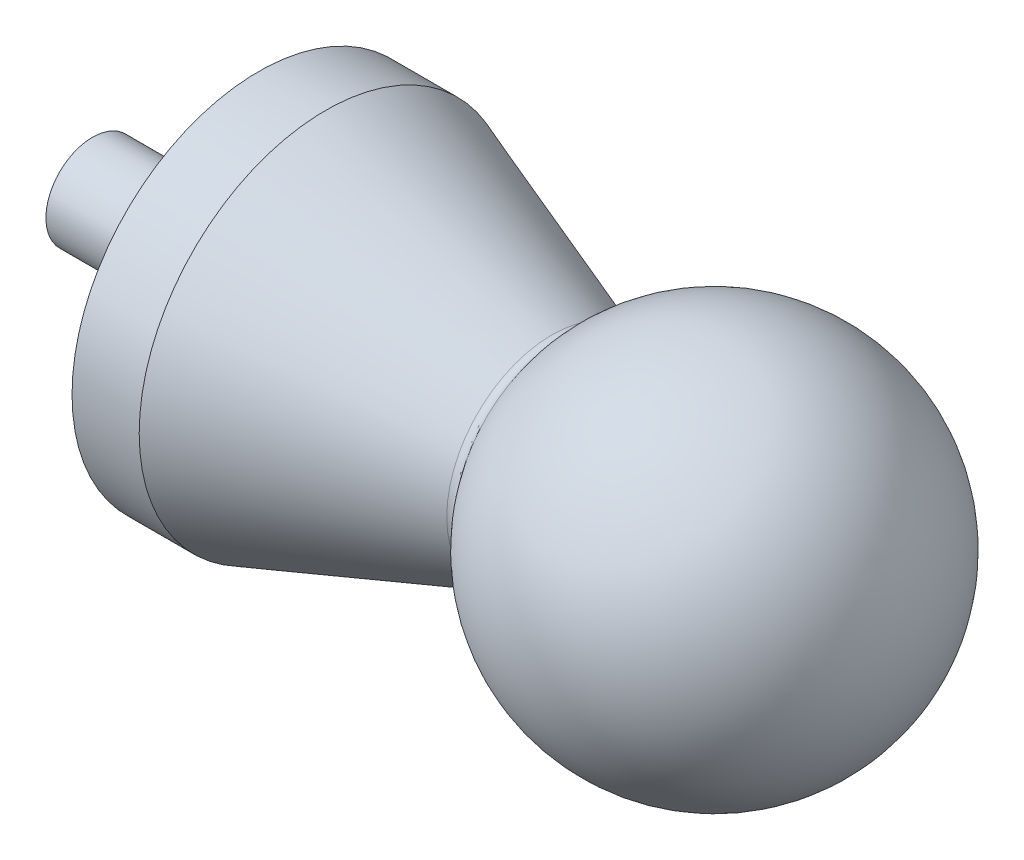
ISO-10303-21;
HEADER;
FILE_DESCRIPTION(('STEP AP214'),'2;1');
FILE_NAME('part.step','',(''),(''),'','','');
FILE_SCHEMA(('AUTOMOTIVE_DESIGN { 1 0 10303 214 1 1 1 1 }'));
ENDSEC;
DATA;
#1=APPLICATION_CONTEXT('core data for automotive mechanical design processes');
#2=APPLICATION_PROTOCOL_DEFINITION('international standard','automotive_design',2000,#1);
#3=PRODUCT_CONTEXT('',#1,'mechanical');
#4=PRODUCT('Part','Part','',(#3));
#5=PRODUCT_RELATED_PRODUCT_CATEGORY('part','',(#4));
#6=PRODUCT_DEFINITION_FORMATION('','',#4);
#7=PRODUCT_DEFINITION_CONTEXT('part definition',#1,'design');
#8=PRODUCT_DEFINITION('design','',#6,#7);
#9=PRODUCT_DEFINITION_SHAPE('','',#8);
#10=(LENGTH_UNIT() NAMED_UNIT(*) SI_UNIT(.MILLI.,.METRE.));
#11=(NAMED_UNIT(*) PLANE_ANGLE_UNIT() SI_UNIT($,.RADIAN.));
#12=(NAMED_UNIT(*) SI_UNIT($,.STERADIAN.) SOLID_ANGLE_UNIT());
#13=UNCERTAINTY_MEASURE_WITH_UNIT(LENGTH_MEASURE(1.E-05),#10,'distance_accuracy_value','');
#14=(GEOMETRIC_REPRESENTATION_CONTEXT(3) GLOBAL_UNCERTAINTY_ASSIGNED_CONTEXT((#13)) GLOBAL_UNIT_ASSIGNED_CONTEXT((#10,
#11,#12)) REPRESENTATION_CONTEXT('',''));
#15=CARTESIAN_POINT('',(0.,0.,0.));
#16=DIRECTION('',(0.,0.,1.));
#17=DIRECTION('',(1.,0.,0.));
#18=AXIS2_PLACEMENT_3D('',#15,#16,#17);
#19=CARTESIAN_POINT('',(25.0028109522093,0.,0.));
#20=DIRECTION('',(1.,0.,0.));
#21=DIRECTION('',(0.,0.,-1.));
#22=AXIS2_PLACEMENT_3D('',#19,#20,#21);
#23=CYLINDRICAL_SURFACE('',#22,9.99999900000003);
#24=CARTESIAN_POINT('',(-133.33332,0.,0.));
#25=DIRECTION('',(1.,0.,0.));
#26=DIRECTION('',(0.,0.,-1.));
#27=AXIS2_PLACEMENT_3D('',#24,#25,#26);
#28=CIRCLE('',#27,9.99999900000003);
#29=CARTESIAN_POINT('',(-133.33332,0.,-9.99999900000003));
#30=VERTEX_POINT('',#29);
#31=EDGE_CURVE('E42',#30,#30,#28,.T.);
#32=ORIENTED_EDGE('',*,*,#31,.T.);
#33=EDGE_LOOP('',(#32));
#34=FACE_BOUND('',#33,.T.);
#35=CARTESIAN_POINT('',(-97.73332356,0.,0.));
#36=DIRECTION('',(1.,0.,0.));
#37=DIRECTION('',(0.,0.,-1.));
#38=AXIS2_PLACEMENT_3D('',#35,#36,#37);
#39=CIRCLE('',#38,9.99999900000003);
#40=CARTESIAN_POINT('',(-97.73332356,0.,-9.99999900000003));
#41=VERTEX_POINT('',#40);
#42=EDGE_CURVE('E54',#41,#41,#39,.T.);
#43=ORIENTED_EDGE('',*,*,#42,.F.);
#44=EDGE_LOOP('',(#43));
#45=FACE_BOUND('',#44,.T.);
#46=ADVANCED_FACE('F31',(#34,#45),#23,.T.);
#47=CARTESIAN_POINT('',(-133.33332,0.,0.));
#48=DIRECTION('',(-1.,0.,0.));
#49=DIRECTION('',(0.,0.,1.));
#50=AXIS2_PLACEMENT_3D('',#47,#48,#49);
#51=PLANE('',#50);
#52=ORIENTED_EDGE('',*,*,#31,.F.);
#53=EDGE_LOOP('',(#52));
#54=FACE_BOUND('',#53,.T.);
#55=ADVANCED_FACE('F62',(#54),#51,.T.);
#56=CARTESIAN_POINT('',(0.,0.,0.));
#57=DIRECTION('',(1.,0.,0.));
#58=DIRECTION('',(0.,0.,1.));
#59=AXIS2_PLACEMENT_3D('',#56,#57,#58);
#60=SPHERICAL_SURFACE('',#59,40.);
#61=CARTESIAN_POINT('',(-32.5399748618754,0.,0.));
#62=DIRECTION('',(1.,0.,0.));
#63=DIRECTION('',(0.,0.,-1.));
#64=AXIS2_PLACEMENT_3D('',#61,#62,#63);
#65=CIRCLE('',#64,23.2626317511265);
#66=CARTESIAN_POINT('',(-32.5399748618754,0.,-23.2626317511265));
#67=VERTEX_POINT('',#66);
#68=EDGE_CURVE('E38',#67,#67,#65,.T.);
#69=ORIENTED_EDGE('',*,*,#68,.T.);
#70=EDGE_LOOP('',(#69));
#71=FACE_BOUND('',#70,.T.);
#72=ADVANCED_FACE('F67',(#71),#60,.T.);
#73=CARTESIAN_POINT('',(-33.3925398117719,0.,0.));
#74=DIRECTION('',(-1.,0.,0.));
#75=DIRECTION('',(0.,0.,1.));
#76=AXIS2_PLACEMENT_3D('',#73,#74,#75);
#77=CONICAL_SURFACE('',#76,22.0213143322379,0.345555580581712);
#78=CARTESIAN_POINT('',(-34.8444125415147,0.,0.));
#79=DIRECTION('',(-1.,0.,0.));
#80=DIRECTION('',(0.,0.,1.));
#81=AXIS2_PLACEMENT_3D('',#78,#79,#80);
#82=CIRCLE('',#81,22.5439885149453);
#83=CARTESIAN_POINT('',(-34.8444125415147,0.,22.5439885149453));
#84=VERTEX_POINT('',#83);
#85=EDGE_CURVE('E10',#84,#84,#82,.T.);
#86=ORIENTED_EDGE('',*,*,#85,.T.);
#87=EDGE_LOOP('',(#86));
#88=FACE_BOUND('',#87,.T.);
#89=CARTESIAN_POINT('',(-83.333328339254,0.,0.));
#90=DIRECTION('',(1.,0.,0.));
#91=DIRECTION('',(0.,0.,-1.));
#92=AXIS2_PLACEMENT_3D('',#89,#90,#91);
#93=CIRCLE('',#92,39.9999982021314);
#94=CARTESIAN_POINT('',(-83.333328339254,0.,-39.9999982021314));
#95=VERTEX_POINT('',#94);
#96=EDGE_CURVE('E46',#95,#95,#93,.T.);
#97=ORIENTED_EDGE('',*,*,#96,.T.);
#98=EDGE_LOOP('',(#97));
#99=FACE_BOUND('',#98,.T.);
#100=ADVANCED_FACE('F73',(#88,#99),#77,.T.);
#101=CARTESIAN_POINT('',(25.0028109522093,0.,0.));
#102=DIRECTION('',(1.,0.,0.));
#103=DIRECTION('',(0.,0.,-1.));
#104=AXIS2_PLACEMENT_3D('',#101,#102,#103);
#105=CYLINDRICAL_SURFACE('',#104,39.9999982021314);
#106=CARTESIAN_POINT('',(-97.73332356,0.,0.));
#107=DIRECTION('',(1.,0.,0.));
#108=DIRECTION('',(0.,0.,-1.));
#109=AXIS2_PLACEMENT_3D('',#106,#107,#108);
#110=CIRCLE('',#109,39.9999982021314);
#111=CARTESIAN_POINT('',(-97.73332356,0.,-39.9999982021314));
#112=VERTEX_POINT('',#111);
#113=EDGE_CURVE('E51',#112,#112,#110,.T.);
#114=ORIENTED_EDGE('',*,*,#113,.T.);
#115=EDGE_LOOP('',(#114));
#116=FACE_BOUND('',#115,.T.);
#117=ORIENTED_EDGE('',*,*,#96,.F.);
#118=EDGE_LOOP('',(#117));
#119=FACE_BOUND('',#118,.T.);
#120=ADVANCED_FACE('F76',(#116,#119),#105,.T.);
#121=CARTESIAN_POINT('',(-97.73332356,0.,-9.99999900000003));
#122=DIRECTION('',(-1.,0.,0.));
#123=DIRECTION('',(0.,0.,1.));
#124=AXIS2_PLACEMENT_3D('',#121,#122,#123);
#125=PLANE('',#124);
#126=ORIENTED_EDGE('',*,*,#42,.T.);
#127=EDGE_LOOP('',(#126));
#128=FACE_BOUND('',#127,.T.);
#129=ORIENTED_EDGE('',*,*,#113,.F.);
#130=EDGE_LOOP('',(#129));
#131=FACE_BOUND('',#130,.T.);
#132=ADVANCED_FACE('F58',(#128,#131),#125,.T.);
#133=CARTESIAN_POINT('',(-34.1669736049692,0.,0.));
#134=DIRECTION('',(1.,0.,0.));
#135=DIRECTION('',(0.,0.,-1.));
#136=AXIS2_PLACEMENT_3D('',#133,#134,#135);
#137=TOROIDAL_SURFACE('',#136,24.4257633386828,2.);
#138=ORIENTED_EDGE('',*,*,#85,.F.);
#139=EDGE_LOOP('',(#138));
#140=FACE_BOUND('',#139,.T.);
#141=ORIENTED_EDGE('',*,*,#68,.F.);
#142=EDGE_LOOP('',(#141));
#143=FACE_BOUND('',#142,.T.);
#144=ADVANCED_FACE('F33',(#140,#143),#137,.F.);
#145=CLOSED_SHELL('',(#46,#55,#72,#100,#120,#132,#144));
#146=MANIFOLD_SOLID_BREP('B2',#145);
#147=ADVANCED_BREP_SHAPE_REPRESENTATION('',(#18,#146),#14);
#148=SHAPE_DEFINITION_REPRESENTATION(#9,#147);
ENDSEC;
END-ISO-10303-21;
